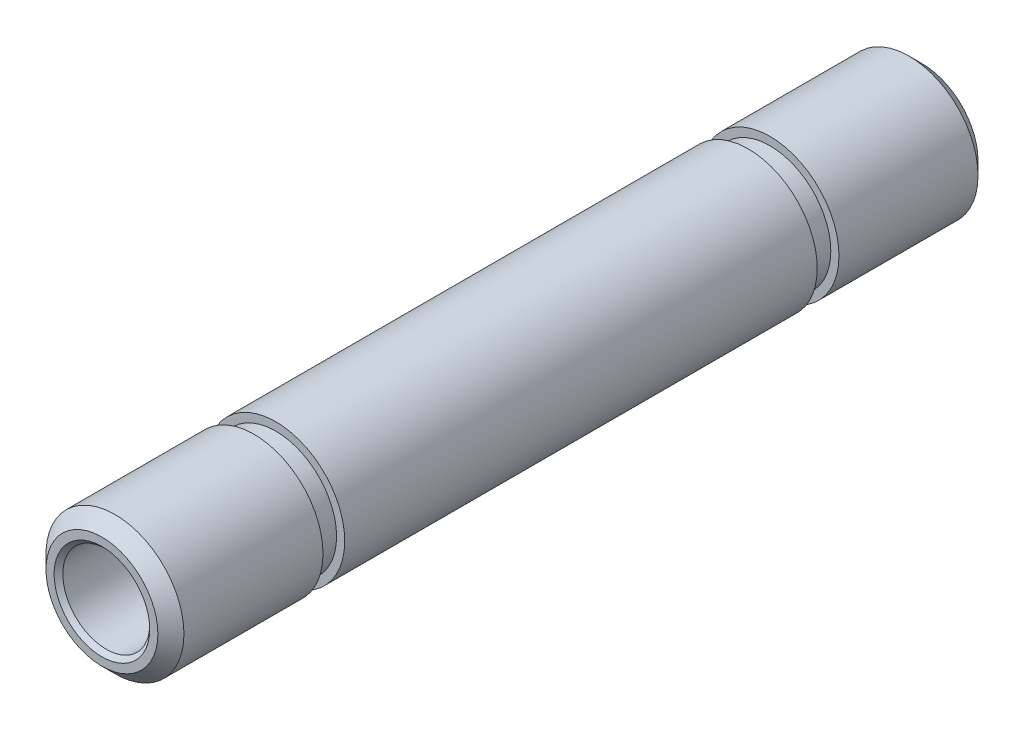
ISO-10303-21;
HEADER;
FILE_DESCRIPTION(('STEP AP214'),'2;1');
FILE_NAME('part.step','',(''),(''),'','','');
FILE_SCHEMA(('AUTOMOTIVE_DESIGN { 1 0 10303 214 1 1 1 1 }'));
ENDSEC;
DATA;
#1=APPLICATION_CONTEXT('core data for automotive mechanical design processes');
#2=APPLICATION_PROTOCOL_DEFINITION('international standard','automotive_design',2000,#1);
#3=PRODUCT_CONTEXT('',#1,'mechanical');
#4=PRODUCT('Part','Part','',(#3));
#5=PRODUCT_RELATED_PRODUCT_CATEGORY('part','',(#4));
#6=PRODUCT_DEFINITION_FORMATION('','',#4);
#7=PRODUCT_DEFINITION_CONTEXT('part definition',#1,'design');
#8=PRODUCT_DEFINITION('design','',#6,#7);
#9=PRODUCT_DEFINITION_SHAPE('','',#8);
#10=(LENGTH_UNIT() NAMED_UNIT(*) SI_UNIT(.MILLI.,.METRE.));
#11=(NAMED_UNIT(*) PLANE_ANGLE_UNIT() SI_UNIT($,.RADIAN.));
#12=(NAMED_UNIT(*) SI_UNIT($,.STERADIAN.) SOLID_ANGLE_UNIT());
#13=UNCERTAINTY_MEASURE_WITH_UNIT(LENGTH_MEASURE(1.E-05),#10,'distance_accuracy_value','');
#14=(GEOMETRIC_REPRESENTATION_CONTEXT(3) GLOBAL_UNCERTAINTY_ASSIGNED_CONTEXT((#13)) GLOBAL_UNIT_ASSIGNED_CONTEXT((#10,
#11,#12)) REPRESENTATION_CONTEXT('',''));
#15=CARTESIAN_POINT('',(0.,0.,0.));
#16=DIRECTION('',(0.,0.,1.));
#17=DIRECTION('',(1.,0.,0.));
#18=AXIS2_PLACEMENT_3D('',#15,#16,#17);
#19=CARTESIAN_POINT('',(0.,0.,-37.75));
#20=DIRECTION('',(0.,0.,1.));
#21=DIRECTION('',(1.,0.,0.));
#22=AXIS2_PLACEMENT_3D('',#19,#20,#21);
#23=CYLINDRICAL_SURFACE('',#22,3.175);
#24=CARTESIAN_POINT('',(0.,0.,-37.15));
#25=DIRECTION('',(0.,0.,1.));
#26=DIRECTION('',(1.,0.,0.));
#27=AXIS2_PLACEMENT_3D('',#24,#25,#26);
#28=CIRCLE('',#27,3.175);
#29=CARTESIAN_POINT('',(3.175,0.,-37.15));
#30=VERTEX_POINT('',#29);
#31=EDGE_CURVE('E37',#30,#30,#28,.T.);
#32=ORIENTED_EDGE('',*,*,#31,.T.);
#33=EDGE_LOOP('',(#32));
#34=FACE_BOUND('',#33,.T.);
#35=CARTESIAN_POINT('',(0.,0.,-30.75));
#36=DIRECTION('',(0.,0.,1.));
#37=DIRECTION('',(1.,0.,0.));
#38=AXIS2_PLACEMENT_3D('',#35,#36,#37);
#39=CIRCLE('',#38,3.175);
#40=CARTESIAN_POINT('',(3.175,0.,-30.75));
#41=VERTEX_POINT('',#40);
#42=EDGE_CURVE('E59',#41,#41,#39,.T.);
#43=ORIENTED_EDGE('',*,*,#42,.F.);
#44=EDGE_LOOP('',(#43));
#45=FACE_BOUND('',#44,.T.);
#46=ADVANCED_FACE('F14',(#34,#45),#23,.T.);
#47=CARTESIAN_POINT('',(0.,0.,-29.75));
#48=DIRECTION('',(0.,0.,1.));
#49=DIRECTION('',(1.,0.,0.));
#50=AXIS2_PLACEMENT_3D('',#47,#48,#49);
#51=CIRCLE('',#50,3.175);
#52=CARTESIAN_POINT('',(3.175,0.,-29.75));
#53=VERTEX_POINT('',#52);
#54=EDGE_CURVE('E56',#53,#53,#51,.T.);
#55=ORIENTED_EDGE('',*,*,#54,.T.);
#56=EDGE_LOOP('',(#55));
#57=FACE_BOUND('',#56,.T.);
#58=CARTESIAN_POINT('',(0.,0.,-8.));
#59=DIRECTION('',(0.,0.,1.));
#60=DIRECTION('',(1.,0.,0.));
#61=AXIS2_PLACEMENT_3D('',#58,#59,#60);
#62=CIRCLE('',#61,3.175);
#63=CARTESIAN_POINT('',(3.175,0.,-8.));
#64=VERTEX_POINT('',#63);
#65=EDGE_CURVE('E46',#64,#64,#62,.T.);
#66=ORIENTED_EDGE('',*,*,#65,.F.);
#67=EDGE_LOOP('',(#66));
#68=FACE_BOUND('',#67,.T.);
#69=ADVANCED_FACE('F93',(#57,#68),#23,.T.);
#70=CARTESIAN_POINT('',(0.,0.,-0.60000000000001));
#71=DIRECTION('',(0.,0.,1.));
#72=DIRECTION('',(1.,0.,0.));
#73=AXIS2_PLACEMENT_3D('',#70,#71,#72);
#74=CIRCLE('',#73,3.175);
#75=CARTESIAN_POINT('',(3.175,0.,-0.60000000000001));
#76=VERTEX_POINT('',#75);
#77=EDGE_CURVE('E40',#76,#76,#74,.F.);
#78=ORIENTED_EDGE('',*,*,#77,.T.);
#79=EDGE_LOOP('',(#78));
#80=FACE_BOUND('',#79,.T.);
#81=CARTESIAN_POINT('',(0.,0.,-7.));
#82=DIRECTION('',(0.,0.,1.));
#83=DIRECTION('',(1.,0.,0.));
#84=AXIS2_PLACEMENT_3D('',#81,#82,#83);
#85=CIRCLE('',#84,3.175);
#86=CARTESIAN_POINT('',(3.175,0.,-7.));
#87=VERTEX_POINT('',#86);
#88=EDGE_CURVE('E47',#87,#87,#85,.T.);
#89=ORIENTED_EDGE('',*,*,#88,.T.);
#90=EDGE_LOOP('',(#89));
#91=FACE_BOUND('',#90,.T.);
#92=ADVANCED_FACE('F96',(#80,#91),#23,.T.);
#93=CARTESIAN_POINT('',(0.,0.,-37.75));
#94=DIRECTION('',(0.,0.,1.));
#95=DIRECTION('',(1.,0.,0.));
#96=AXIS2_PLACEMENT_3D('',#93,#94,#95);
#97=PLANE('',#96);
#98=CARTESIAN_POINT('',(0.,0.,-37.75));
#99=DIRECTION('',(0.,0.,1.));
#100=DIRECTION('',(1.,0.,0.));
#101=AXIS2_PLACEMENT_3D('',#98,#99,#100);
#102=CIRCLE('',#101,2.2);
#103=CARTESIAN_POINT('',(2.2,0.,-37.75));
#104=VERTEX_POINT('',#103);
#105=EDGE_CURVE('E21',#104,#104,#102,.T.);
#106=ORIENTED_EDGE('',*,*,#105,.T.);
#107=EDGE_LOOP('',(#106));
#108=FACE_BOUND('',#107,.T.);
#109=CARTESIAN_POINT('',(0.,0.,-37.75));
#110=DIRECTION('',(0.,0.,1.));
#111=DIRECTION('',(1.,0.,0.));
#112=AXIS2_PLACEMENT_3D('',#109,#110,#111);
#113=CIRCLE('',#112,2.575);
#114=CARTESIAN_POINT('',(2.575,0.,-37.75));
#115=VERTEX_POINT('',#114);
#116=EDGE_CURVE('E34',#115,#115,#113,.F.);
#117=ORIENTED_EDGE('',*,*,#116,.T.);
#118=EDGE_LOOP('',(#117));
#119=FACE_BOUND('',#118,.T.);
#120=ADVANCED_FACE('F105',(#108,#119),#97,.F.);
#121=CARTESIAN_POINT('',(0.,0.,0.));
#122=DIRECTION('',(0.,0.,1.));
#123=DIRECTION('',(1.,0.,0.));
#124=AXIS2_PLACEMENT_3D('',#121,#122,#123);
#125=PLANE('',#124);
#126=CARTESIAN_POINT('',(0.,0.,0.));
#127=DIRECTION('',(0.,0.,1.));
#128=DIRECTION('',(1.,0.,0.));
#129=AXIS2_PLACEMENT_3D('',#126,#127,#128);
#130=CIRCLE('',#129,2.2);
#131=CARTESIAN_POINT('',(2.2,0.,0.));
#132=VERTEX_POINT('',#131);
#133=EDGE_CURVE('E25',#132,#132,#130,.F.);
#134=ORIENTED_EDGE('',*,*,#133,.T.);
#135=EDGE_LOOP('',(#134));
#136=FACE_BOUND('',#135,.T.);
#137=CARTESIAN_POINT('',(0.,0.,0.));
#138=DIRECTION('',(0.,0.,1.));
#139=DIRECTION('',(1.,0.,0.));
#140=AXIS2_PLACEMENT_3D('',#137,#138,#139);
#141=CIRCLE('',#140,2.575);
#142=CARTESIAN_POINT('',(2.575,0.,0.));
#143=VERTEX_POINT('',#142);
#144=EDGE_CURVE('E43',#143,#143,#141,.T.);
#145=ORIENTED_EDGE('',*,*,#144,.T.);
#146=EDGE_LOOP('',(#145));
#147=FACE_BOUND('',#146,.T.);
#148=ADVANCED_FACE('F110',(#136,#147),#125,.T.);
#149=CARTESIAN_POINT('',(0.,0.,-37.75));
#150=DIRECTION('',(0.,0.,1.));
#151=DIRECTION('',(1.,0.,0.));
#152=AXIS2_PLACEMENT_3D('',#149,#150,#151);
#153=CYLINDRICAL_SURFACE('',#152,2.);
#154=CARTESIAN_POINT('',(0.,0.,-37.55));
#155=DIRECTION('',(0.,0.,1.));
#156=DIRECTION('',(1.,0.,0.));
#157=AXIS2_PLACEMENT_3D('',#154,#155,#156);
#158=CIRCLE('',#157,2.);
#159=CARTESIAN_POINT('',(2.,0.,-37.55));
#160=VERTEX_POINT('',#159);
#161=EDGE_CURVE('E10',#160,#160,#158,.F.);
#162=ORIENTED_EDGE('',*,*,#161,.T.);
#163=EDGE_LOOP('',(#162));
#164=FACE_BOUND('',#163,.T.);
#165=CARTESIAN_POINT('',(0.,0.,-0.199999999999999));
#166=DIRECTION('',(0.,0.,1.));
#167=DIRECTION('',(1.,0.,0.));
#168=AXIS2_PLACEMENT_3D('',#165,#166,#167);
#169=CIRCLE('',#168,2.);
#170=CARTESIAN_POINT('',(2.,0.,-0.199999999999999));
#171=VERTEX_POINT('',#170);
#172=EDGE_CURVE('E29',#171,#171,#169,.T.);
#173=ORIENTED_EDGE('',*,*,#172,.T.);
#174=EDGE_LOOP('',(#173));
#175=FACE_BOUND('',#174,.T.);
#176=ADVANCED_FACE('F126',(#164,#175),#153,.F.);
#177=CARTESIAN_POINT('',(0.,0.,-8.));
#178=DIRECTION('',(0.,0.,1.));
#179=DIRECTION('',(1.,0.,0.));
#180=AXIS2_PLACEMENT_3D('',#177,#178,#179);
#181=PLANE('',#180);
#182=CARTESIAN_POINT('',(0.,0.,-8.));
#183=DIRECTION('',(0.,0.,1.));
#184=DIRECTION('',(1.,0.,0.));
#185=AXIS2_PLACEMENT_3D('',#182,#183,#184);
#186=CIRCLE('',#185,2.8);
#187=CARTESIAN_POINT('',(2.8,0.,-8.));
#188=VERTEX_POINT('',#187);
#189=EDGE_CURVE('E50',#188,#188,#186,.T.);
#190=ORIENTED_EDGE('',*,*,#189,.F.);
#191=EDGE_LOOP('',(#190));
#192=FACE_BOUND('',#191,.T.);
#193=ORIENTED_EDGE('',*,*,#65,.T.);
#194=EDGE_LOOP('',(#193));
#195=FACE_BOUND('',#194,.T.);
#196=ADVANCED_FACE('F118',(#192,#195),#181,.T.);
#197=CARTESIAN_POINT('',(0.,0.,-7.));
#198=DIRECTION('',(0.,0.,1.));
#199=DIRECTION('',(1.,0.,0.));
#200=AXIS2_PLACEMENT_3D('',#197,#198,#199);
#201=PLANE('',#200);
#202=CARTESIAN_POINT('',(0.,0.,-7.));
#203=DIRECTION('',(0.,0.,1.));
#204=DIRECTION('',(1.,0.,0.));
#205=AXIS2_PLACEMENT_3D('',#202,#203,#204);
#206=CIRCLE('',#205,2.8);
#207=CARTESIAN_POINT('',(2.8,0.,-7.));
#208=VERTEX_POINT('',#207);
#209=EDGE_CURVE('E53',#208,#208,#206,.T.);
#210=ORIENTED_EDGE('',*,*,#209,.T.);
#211=EDGE_LOOP('',(#210));
#212=FACE_BOUND('',#211,.T.);
#213=ORIENTED_EDGE('',*,*,#88,.F.);
#214=EDGE_LOOP('',(#213));
#215=FACE_BOUND('',#214,.T.);
#216=ADVANCED_FACE('F116',(#212,#215),#201,.F.);
#217=CARTESIAN_POINT('',(0.,0.,-8.));
#218=DIRECTION('',(0.,0.,1.));
#219=DIRECTION('',(1.,0.,0.));
#220=AXIS2_PLACEMENT_3D('',#217,#218,#219);
#221=CYLINDRICAL_SURFACE('',#220,2.8);
#222=ORIENTED_EDGE('',*,*,#189,.T.);
#223=EDGE_LOOP('',(#222));
#224=FACE_BOUND('',#223,.T.);
#225=ORIENTED_EDGE('',*,*,#209,.F.);
#226=EDGE_LOOP('',(#225));
#227=FACE_BOUND('',#226,.T.);
#228=ADVANCED_FACE('F88',(#224,#227),#221,.T.);
#229=CARTESIAN_POINT('',(0.,0.,-29.75));
#230=DIRECTION('',(0.,0.,1.));
#231=DIRECTION('',(1.,0.,0.));
#232=AXIS2_PLACEMENT_3D('',#229,#230,#231);
#233=PLANE('',#232);
#234=ORIENTED_EDGE('',*,*,#54,.F.);
#235=EDGE_LOOP('',(#234));
#236=FACE_BOUND('',#235,.T.);
#237=CARTESIAN_POINT('',(0.,0.,-29.75));
#238=DIRECTION('',(0.,0.,1.));
#239=DIRECTION('',(1.,0.,0.));
#240=AXIS2_PLACEMENT_3D('',#237,#238,#239);
#241=CIRCLE('',#240,2.8);
#242=CARTESIAN_POINT('',(2.8,0.,-29.75));
#243=VERTEX_POINT('',#242);
#244=EDGE_CURVE('E62',#243,#243,#241,.T.);
#245=ORIENTED_EDGE('',*,*,#244,.T.);
#246=EDGE_LOOP('',(#245));
#247=FACE_BOUND('',#246,.T.);
#248=ADVANCED_FACE('F71',(#236,#247),#233,.F.);
#249=CARTESIAN_POINT('',(0.,0.,-30.75));
#250=DIRECTION('',(0.,0.,1.));
#251=DIRECTION('',(1.,0.,0.));
#252=AXIS2_PLACEMENT_3D('',#249,#250,#251);
#253=PLANE('',#252);
#254=ORIENTED_EDGE('',*,*,#42,.T.);
#255=EDGE_LOOP('',(#254));
#256=FACE_BOUND('',#255,.T.);
#257=CARTESIAN_POINT('',(0.,0.,-30.75));
#258=DIRECTION('',(0.,0.,1.));
#259=DIRECTION('',(1.,0.,0.));
#260=AXIS2_PLACEMENT_3D('',#257,#258,#259);
#261=CIRCLE('',#260,2.8);
#262=CARTESIAN_POINT('',(2.8,0.,-30.75));
#263=VERTEX_POINT('',#262);
#264=EDGE_CURVE('E65',#263,#263,#261,.T.);
#265=ORIENTED_EDGE('',*,*,#264,.F.);
#266=EDGE_LOOP('',(#265));
#267=FACE_BOUND('',#266,.T.);
#268=ADVANCED_FACE('F77',(#256,#267),#253,.T.);
#269=CARTESIAN_POINT('',(0.,0.,-29.75));
#270=DIRECTION('',(0.,0.,-1.));
#271=DIRECTION('',(-1.,0.,0.));
#272=AXIS2_PLACEMENT_3D('',#269,#270,#271);
#273=CYLINDRICAL_SURFACE('',#272,2.8);
#274=ORIENTED_EDGE('',*,*,#244,.F.);
#275=EDGE_LOOP('',(#274));
#276=FACE_BOUND('',#275,.T.);
#277=ORIENTED_EDGE('',*,*,#264,.T.);
#278=EDGE_LOOP('',(#277));
#279=FACE_BOUND('',#278,.T.);
#280=ADVANCED_FACE('F73',(#276,#279),#273,.T.);
#281=CARTESIAN_POINT('',(0.,0.,0.));
#282=DIRECTION('',(0.,0.,-1.));
#283=DIRECTION('',(-1.,0.,0.));
#284=AXIS2_PLACEMENT_3D('',#281,#282,#283);
#285=CONICAL_SURFACE('',#284,2.575,0.785398163397442);
#286=ORIENTED_EDGE('',*,*,#77,.F.);
#287=EDGE_LOOP('',(#286));
#288=FACE_BOUND('',#287,.T.);
#289=ORIENTED_EDGE('',*,*,#144,.F.);
#290=EDGE_LOOP('',(#289));
#291=FACE_BOUND('',#290,.T.);
#292=ADVANCED_FACE('F76',(#288,#291),#285,.T.);
#293=CARTESIAN_POINT('',(0.,0.,-37.15));
#294=DIRECTION('',(0.,0.,1.));
#295=DIRECTION('',(1.,0.,0.));
#296=AXIS2_PLACEMENT_3D('',#293,#294,#295);
#297=CONICAL_SURFACE('',#296,3.175,0.78539816339745);
#298=ORIENTED_EDGE('',*,*,#116,.F.);
#299=EDGE_LOOP('',(#298));
#300=FACE_BOUND('',#299,.T.);
#301=ORIENTED_EDGE('',*,*,#31,.F.);
#302=EDGE_LOOP('',(#301));
#303=FACE_BOUND('',#302,.T.);
#304=ADVANCED_FACE('F140',(#300,#303),#297,.T.);
#305=CARTESIAN_POINT('',(0.,0.,-0.199999999999999));
#306=DIRECTION('',(0.,0.,1.));
#307=DIRECTION('',(1.,0.,0.));
#308=AXIS2_PLACEMENT_3D('',#305,#306,#307);
#309=CONICAL_SURFACE('',#308,2.,0.785398163397444);
#310=ORIENTED_EDGE('',*,*,#133,.F.);
#311=EDGE_LOOP('',(#310));
#312=FACE_BOUND('',#311,.T.);
#313=ORIENTED_EDGE('',*,*,#172,.F.);
#314=EDGE_LOOP('',(#313));
#315=FACE_BOUND('',#314,.T.);
#316=ADVANCED_FACE('F145',(#312,#315),#309,.F.);
#317=CARTESIAN_POINT('',(0.,0.,-37.75));
#318=DIRECTION('',(0.,0.,-1.));
#319=DIRECTION('',(-1.,0.,0.));
#320=AXIS2_PLACEMENT_3D('',#317,#318,#319);
#321=CONICAL_SURFACE('',#320,2.2,0.785398163397461);
#322=ORIENTED_EDGE('',*,*,#161,.F.);
#323=EDGE_LOOP('',(#322));
#324=FACE_BOUND('',#323,.T.);
#325=ORIENTED_EDGE('',*,*,#105,.F.);
#326=EDGE_LOOP('',(#325));
#327=FACE_BOUND('',#326,.T.);
#328=ADVANCED_FACE('F16',(#324,#327),#321,.F.);
#329=CLOSED_SHELL('',(#46,#69,#92,#120,#148,#176,#196,#216,#228,#248,#268,#280,#292,#304,#316,#328));
#330=MANIFOLD_SOLID_BREP('B1',#329);
#331=ADVANCED_BREP_SHAPE_REPRESENTATION('',(#18,#330),#14);
#332=SHAPE_DEFINITION_REPRESENTATION(#9,#331);
ENDSEC;
END-ISO-10303-21;
